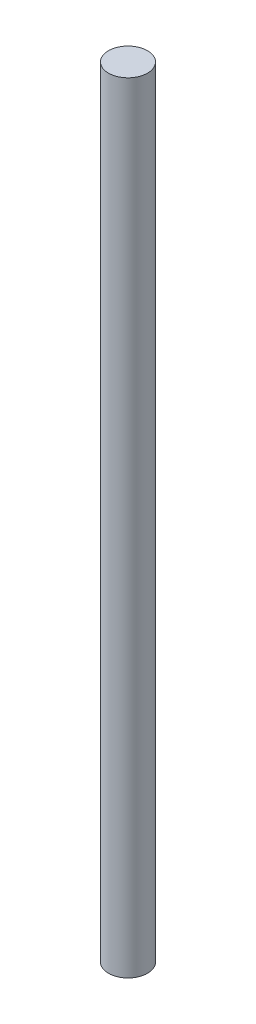
ISO-10303-21;
HEADER;
FILE_DESCRIPTION(('STEP AP214'),'2;1');
FILE_NAME('part.step','',(''),(''),'','','');
FILE_SCHEMA(('AUTOMOTIVE_DESIGN { 1 0 10303 214 1 1 1 1 }'));
ENDSEC;
DATA;
#1=APPLICATION_CONTEXT('core data for automotive mechanical design processes');
#2=APPLICATION_PROTOCOL_DEFINITION('international standard','automotive_design',2000,#1);
#3=PRODUCT_CONTEXT('',#1,'mechanical');
#4=PRODUCT('Part','Part','',(#3));
#5=PRODUCT_RELATED_PRODUCT_CATEGORY('part','',(#4));
#6=PRODUCT_DEFINITION_FORMATION('','',#4);
#7=PRODUCT_DEFINITION_CONTEXT('part definition',#1,'design');
#8=PRODUCT_DEFINITION('design','',#6,#7);
#9=PRODUCT_DEFINITION_SHAPE('','',#8);
#10=(LENGTH_UNIT() NAMED_UNIT(*) SI_UNIT(.MILLI.,.METRE.));
#11=(NAMED_UNIT(*) PLANE_ANGLE_UNIT() SI_UNIT($,.RADIAN.));
#12=(NAMED_UNIT(*) SI_UNIT($,.STERADIAN.) SOLID_ANGLE_UNIT());
#13=UNCERTAINTY_MEASURE_WITH_UNIT(LENGTH_MEASURE(1.E-05),#10,'distance_accuracy_value','');
#14=(GEOMETRIC_REPRESENTATION_CONTEXT(3) GLOBAL_UNCERTAINTY_ASSIGNED_CONTEXT((#13)) GLOBAL_UNIT_ASSIGNED_CONTEXT((#10,
#11,#12)) REPRESENTATION_CONTEXT('',''));
#15=CARTESIAN_POINT('',(0.,0.,0.));
#16=DIRECTION('',(0.,0.,1.));
#17=DIRECTION('',(1.,0.,0.));
#18=AXIS2_PLACEMENT_3D('',#15,#16,#17);
#19=CARTESIAN_POINT('',(0.,400.,0.));
#20=DIRECTION('',(0.,-1.,0.));
#21=DIRECTION('',(0.,0.,-1.));
#22=AXIS2_PLACEMENT_3D('',#19,#20,#21);
#23=CYLINDRICAL_SURFACE('',#22,10.);
#24=CARTESIAN_POINT('',(0.,400.,0.));
#25=DIRECTION('',(0.,1.,0.));
#26=DIRECTION('',(0.,0.,1.));
#27=AXIS2_PLACEMENT_3D('',#24,#25,#26);
#28=CIRCLE('',#27,10.);
#29=CARTESIAN_POINT('',(0.,400.,10.));
#30=VERTEX_POINT('',#29);
#31=EDGE_CURVE('E10',#30,#30,#28,.T.);
#32=ORIENTED_EDGE('',*,*,#31,.F.);
#33=EDGE_LOOP('',(#32));
#34=FACE_BOUND('',#33,.T.);
#35=CARTESIAN_POINT('',(0.,0.,0.));
#36=DIRECTION('',(0.,1.,0.));
#37=DIRECTION('',(0.,0.,1.));
#38=AXIS2_PLACEMENT_3D('',#35,#36,#37);
#39=CIRCLE('',#38,10.);
#40=CARTESIAN_POINT('',(0.,0.,10.));
#41=VERTEX_POINT('',#40);
#42=EDGE_CURVE('E34',#41,#41,#39,.T.);
#43=ORIENTED_EDGE('',*,*,#42,.T.);
#44=EDGE_LOOP('',(#43));
#45=FACE_BOUND('',#44,.T.);
#46=ADVANCED_FACE('F31',(#34,#45),#23,.T.);
#47=CARTESIAN_POINT('',(0.,400.,0.));
#48=DIRECTION('',(0.,1.,0.));
#49=DIRECTION('',(0.,0.,1.));
#50=AXIS2_PLACEMENT_3D('',#47,#48,#49);
#51=PLANE('',#50);
#52=ORIENTED_EDGE('',*,*,#31,.T.);
#53=EDGE_LOOP('',(#52));
#54=FACE_BOUND('',#53,.T.);
#55=ADVANCED_FACE('F46',(#54),#51,.T.);
#56=CARTESIAN_POINT('',(0.,0.,0.));
#57=DIRECTION('',(0.,1.,0.));
#58=DIRECTION('',(0.,0.,1.));
#59=AXIS2_PLACEMENT_3D('',#56,#57,#58);
#60=PLANE('',#59);
#61=ORIENTED_EDGE('',*,*,#42,.F.);
#62=EDGE_LOOP('',(#61));
#63=FACE_BOUND('',#62,.T.);
#64=ADVANCED_FACE('F44',(#63),#60,.F.);
#65=CLOSED_SHELL('',(#46,#55,#64));
#66=MANIFOLD_SOLID_BREP('B2',#65);
#67=ADVANCED_BREP_SHAPE_REPRESENTATION('',(#18,#66),#14);
#68=SHAPE_DEFINITION_REPRESENTATION(#9,#67);
ENDSEC;
END-ISO-10303-21;
